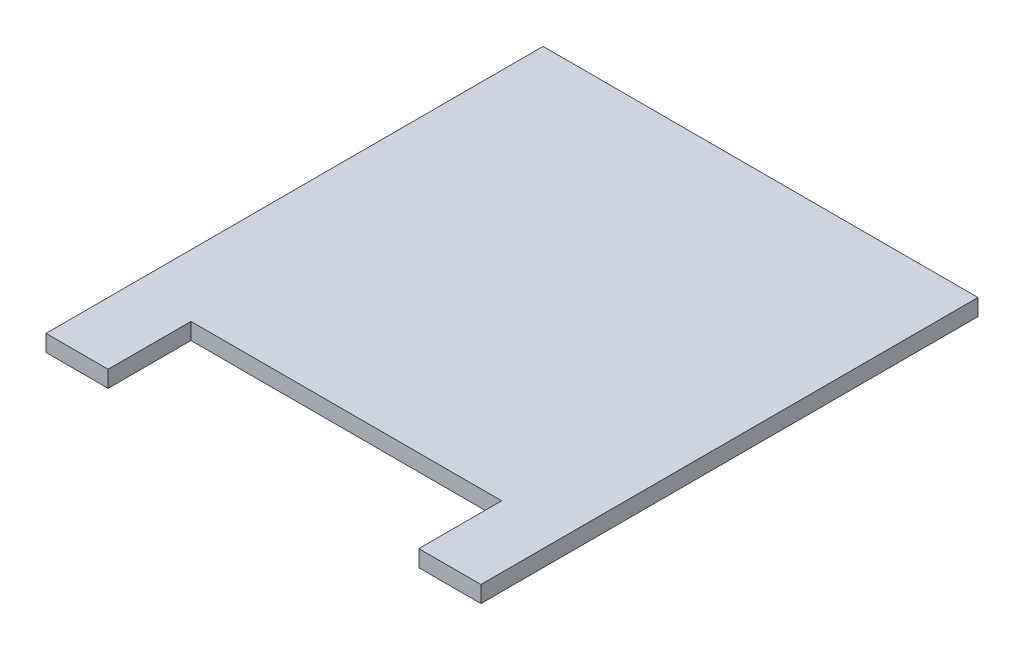
ISO-10303-21;
HEADER;
FILE_DESCRIPTION(('STEP AP214'),'2;1');
FILE_NAME('part.step','',(''),(''),'','','');
FILE_SCHEMA(('AUTOMOTIVE_DESIGN { 1 0 10303 214 1 1 1 1 }'));
ENDSEC;
DATA;
#1=APPLICATION_CONTEXT('core data for automotive mechanical design processes');
#2=APPLICATION_PROTOCOL_DEFINITION('international standard','automotive_design',2000,#1);
#3=PRODUCT_CONTEXT('',#1,'mechanical');
#4=PRODUCT('Part','Part','',(#3));
#5=PRODUCT_RELATED_PRODUCT_CATEGORY('part','',(#4));
#6=PRODUCT_DEFINITION_FORMATION('','',#4);
#7=PRODUCT_DEFINITION_CONTEXT('part definition',#1,'design');
#8=PRODUCT_DEFINITION('design','',#6,#7);
#9=PRODUCT_DEFINITION_SHAPE('','',#8);
#10=(LENGTH_UNIT() NAMED_UNIT(*) SI_UNIT(.MILLI.,.METRE.));
#11=(NAMED_UNIT(*) PLANE_ANGLE_UNIT() SI_UNIT($,.RADIAN.));
#12=(NAMED_UNIT(*) SI_UNIT($,.STERADIAN.) SOLID_ANGLE_UNIT());
#13=UNCERTAINTY_MEASURE_WITH_UNIT(LENGTH_MEASURE(1.E-05),#10,'distance_accuracy_value','');
#14=(GEOMETRIC_REPRESENTATION_CONTEXT(3) GLOBAL_UNCERTAINTY_ASSIGNED_CONTEXT((#13)) GLOBAL_UNIT_ASSIGNED_CONTEXT((#10,
#11,#12)) REPRESENTATION_CONTEXT('',''));
#15=CARTESIAN_POINT('',(0.,0.,0.));
#16=DIRECTION('',(0.,0.,1.));
#17=DIRECTION('',(1.,0.,0.));
#18=AXIS2_PLACEMENT_3D('',#15,#16,#17);
#19=CARTESIAN_POINT('',(210.,16.,240.));
#20=DIRECTION('',(-1.,0.,0.));
#21=DIRECTION('',(0.,0.,1.));
#22=AXIS2_PLACEMENT_3D('',#19,#20,#21);
#23=PLANE('',#22);
#24=DIRECTION('',(0.,0.,-1.));
#25=VECTOR('',#24,1.);
#26=CARTESIAN_POINT('',(210.,0.,240.));
#27=LINE('',#26,#25);
#28=CARTESIAN_POINT('',(210.,0.,240.));
#29=VERTEX_POINT('',#28);
#30=CARTESIAN_POINT('',(210.,0.,-240.));
#31=VERTEX_POINT('',#30);
#32=EDGE_CURVE('E129',#29,#31,#27,.T.);
#33=ORIENTED_EDGE('',*,*,#32,.T.);
#34=DIRECTION('',(0.,-1.,0.));
#35=VECTOR('',#34,1.);
#36=CARTESIAN_POINT('',(210.,16.,-240.));
#37=LINE('',#36,#35);
#38=CARTESIAN_POINT('',(210.,16.,-240.));
#39=VERTEX_POINT('',#38);
#40=EDGE_CURVE('E11',#39,#31,#37,.T.);
#41=ORIENTED_EDGE('',*,*,#40,.F.);
#42=DIRECTION('',(0.,0.,-1.));
#43=VECTOR('',#42,1.);
#44=CARTESIAN_POINT('',(210.,16.,240.));
#45=LINE('',#44,#43);
#46=CARTESIAN_POINT('',(210.,16.,240.));
#47=VERTEX_POINT('',#46);
#48=EDGE_CURVE('E143',#47,#39,#45,.T.);
#49=ORIENTED_EDGE('',*,*,#48,.F.);
#50=DIRECTION('',(0.,-1.,0.));
#51=VECTOR('',#50,1.);
#52=CARTESIAN_POINT('',(210.,16.,240.));
#53=LINE('',#52,#51);
#54=EDGE_CURVE('E125',#47,#29,#53,.T.);
#55=ORIENTED_EDGE('',*,*,#54,.T.);
#56=EDGE_LOOP('',(#33,#41,#49,#55));
#57=FACE_BOUND('',#56,.T.);
#58=ADVANCED_FACE('F33',(#57),#23,.F.);
#59=CARTESIAN_POINT('',(-210.,16.,-240.));
#60=DIRECTION('',(0.,0.,1.));
#61=DIRECTION('',(1.,0.,0.));
#62=AXIS2_PLACEMENT_3D('',#59,#60,#61);
#63=PLANE('',#62);
#64=DIRECTION('',(-1.,0.,0.));
#65=VECTOR('',#64,1.);
#66=CARTESIAN_POINT('',(-210.,0.,-240.));
#67=LINE('',#66,#65);
#68=CARTESIAN_POINT('',(-210.,0.,-240.));
#69=VERTEX_POINT('',#68);
#70=EDGE_CURVE('E132',#31,#69,#67,.T.);
#71=ORIENTED_EDGE('',*,*,#70,.T.);
#72=DIRECTION('',(0.,-1.,0.));
#73=VECTOR('',#72,1.);
#74=CARTESIAN_POINT('',(-210.,16.,-240.));
#75=LINE('',#74,#73);
#76=CARTESIAN_POINT('',(-210.,16.,-240.));
#77=VERTEX_POINT('',#76);
#78=EDGE_CURVE('E41',#77,#69,#75,.T.);
#79=ORIENTED_EDGE('',*,*,#78,.F.);
#80=DIRECTION('',(-1.,0.,0.));
#81=VECTOR('',#80,1.);
#82=CARTESIAN_POINT('',(-210.,16.,-240.));
#83=LINE('',#82,#81);
#84=EDGE_CURVE('E92',#39,#77,#83,.T.);
#85=ORIENTED_EDGE('',*,*,#84,.F.);
#86=ORIENTED_EDGE('',*,*,#40,.T.);
#87=EDGE_LOOP('',(#71,#79,#85,#86));
#88=FACE_BOUND('',#87,.T.);
#89=ADVANCED_FACE('F178',(#88),#63,.F.);
#90=CARTESIAN_POINT('',(-210.,16.,240.));
#91=DIRECTION('',(1.,0.,0.));
#92=DIRECTION('',(0.,0.,-1.));
#93=AXIS2_PLACEMENT_3D('',#90,#91,#92);
#94=PLANE('',#93);
#95=DIRECTION('',(0.,0.,1.));
#96=VECTOR('',#95,1.);
#97=CARTESIAN_POINT('',(-210.,0.,240.));
#98=LINE('',#97,#96);
#99=CARTESIAN_POINT('',(-210.,0.,240.));
#100=VERTEX_POINT('',#99);
#101=EDGE_CURVE('E134',#69,#100,#98,.T.);
#102=ORIENTED_EDGE('',*,*,#101,.T.);
#103=DIRECTION('',(0.,-1.,0.));
#104=VECTOR('',#103,1.);
#105=CARTESIAN_POINT('',(-210.,16.,240.));
#106=LINE('',#105,#104);
#107=CARTESIAN_POINT('',(-210.,16.,240.));
#108=VERTEX_POINT('',#107);
#109=EDGE_CURVE('E150',#108,#100,#106,.T.);
#110=ORIENTED_EDGE('',*,*,#109,.F.);
#111=DIRECTION('',(0.,0.,1.));
#112=VECTOR('',#111,1.);
#113=CARTESIAN_POINT('',(-210.,16.,240.));
#114=LINE('',#113,#112);
#115=EDGE_CURVE('E158',#77,#108,#114,.T.);
#116=ORIENTED_EDGE('',*,*,#115,.F.);
#117=ORIENTED_EDGE('',*,*,#78,.T.);
#118=EDGE_LOOP('',(#102,#110,#116,#117));
#119=FACE_BOUND('',#118,.T.);
#120=ADVANCED_FACE('F156',(#119),#94,.F.);
#121=CARTESIAN_POINT('',(-210.,16.,240.));
#122=DIRECTION('',(0.,0.,-1.));
#123=DIRECTION('',(-1.,0.,0.));
#124=AXIS2_PLACEMENT_3D('',#121,#122,#123);
#125=PLANE('',#124);
#126=DIRECTION('',(1.,0.,0.));
#127=VECTOR('',#126,1.);
#128=CARTESIAN_POINT('',(-210.,0.,240.));
#129=LINE('',#128,#127);
#130=CARTESIAN_POINT('',(-150.,0.,240.));
#131=VERTEX_POINT('',#130);
#132=EDGE_CURVE('E136',#100,#131,#129,.T.);
#133=ORIENTED_EDGE('',*,*,#132,.T.);
#134=DIRECTION('',(0.,-1.,0.));
#135=VECTOR('',#134,1.);
#136=CARTESIAN_POINT('',(-150.,16.,240.));
#137=LINE('',#136,#135);
#138=CARTESIAN_POINT('',(-150.,16.,240.));
#139=VERTEX_POINT('',#138);
#140=EDGE_CURVE('E147',#139,#131,#137,.T.);
#141=ORIENTED_EDGE('',*,*,#140,.F.);
#142=DIRECTION('',(1.,0.,0.));
#143=VECTOR('',#142,1.);
#144=CARTESIAN_POINT('',(-210.,16.,240.));
#145=LINE('',#144,#143);
#146=EDGE_CURVE('E170',#108,#139,#145,.T.);
#147=ORIENTED_EDGE('',*,*,#146,.F.);
#148=ORIENTED_EDGE('',*,*,#109,.T.);
#149=EDGE_LOOP('',(#133,#141,#147,#148));
#150=FACE_BOUND('',#149,.T.);
#151=ADVANCED_FACE('F166',(#150),#125,.F.);
#152=CARTESIAN_POINT('',(-150.,16.,240.));
#153=DIRECTION('',(-1.,0.,0.));
#154=DIRECTION('',(0.,0.,1.));
#155=AXIS2_PLACEMENT_3D('',#152,#153,#154);
#156=PLANE('',#155);
#157=DIRECTION('',(0.,0.,-1.));
#158=VECTOR('',#157,1.);
#159=CARTESIAN_POINT('',(-150.,0.,240.));
#160=LINE('',#159,#158);
#161=CARTESIAN_POINT('',(-150.,0.,160.));
#162=VERTEX_POINT('',#161);
#163=EDGE_CURVE('E138',#131,#162,#160,.T.);
#164=ORIENTED_EDGE('',*,*,#163,.T.);
#165=DIRECTION('',(0.,-1.,0.));
#166=VECTOR('',#165,1.);
#167=CARTESIAN_POINT('',(-150.,16.,160.));
#168=LINE('',#167,#166);
#169=CARTESIAN_POINT('',(-150.,16.,160.));
#170=VERTEX_POINT('',#169);
#171=EDGE_CURVE('E120',#170,#162,#168,.T.);
#172=ORIENTED_EDGE('',*,*,#171,.F.);
#173=DIRECTION('',(0.,0.,-1.));
#174=VECTOR('',#173,1.);
#175=CARTESIAN_POINT('',(-150.,16.,240.));
#176=LINE('',#175,#174);
#177=EDGE_CURVE('E111',#139,#170,#176,.T.);
#178=ORIENTED_EDGE('',*,*,#177,.F.);
#179=ORIENTED_EDGE('',*,*,#140,.T.);
#180=EDGE_LOOP('',(#164,#172,#178,#179));
#181=FACE_BOUND('',#180,.T.);
#182=ADVANCED_FACE('F169',(#181),#156,.F.);
#183=CARTESIAN_POINT('',(-150.,16.,160.));
#184=DIRECTION('',(0.,0.,-1.));
#185=DIRECTION('',(-1.,0.,0.));
#186=AXIS2_PLACEMENT_3D('',#183,#184,#185);
#187=PLANE('',#186);
#188=DIRECTION('',(1.,0.,0.));
#189=VECTOR('',#188,1.);
#190=CARTESIAN_POINT('',(-150.,0.,160.));
#191=LINE('',#190,#189);
#192=CARTESIAN_POINT('',(150.,0.,160.));
#193=VERTEX_POINT('',#192);
#194=EDGE_CURVE('E119',#162,#193,#191,.T.);
#195=ORIENTED_EDGE('',*,*,#194,.T.);
#196=DIRECTION('',(0.,-1.,0.));
#197=VECTOR('',#196,1.);
#198=CARTESIAN_POINT('',(150.,16.,160.));
#199=LINE('',#198,#197);
#200=CARTESIAN_POINT('',(150.,16.,160.));
#201=VERTEX_POINT('',#200);
#202=EDGE_CURVE('E116',#201,#193,#199,.T.);
#203=ORIENTED_EDGE('',*,*,#202,.F.);
#204=DIRECTION('',(1.,0.,0.));
#205=VECTOR('',#204,1.);
#206=CARTESIAN_POINT('',(-150.,16.,160.));
#207=LINE('',#206,#205);
#208=EDGE_CURVE('E105',#170,#201,#207,.T.);
#209=ORIENTED_EDGE('',*,*,#208,.F.);
#210=ORIENTED_EDGE('',*,*,#171,.T.);
#211=EDGE_LOOP('',(#195,#203,#209,#210));
#212=FACE_BOUND('',#211,.T.);
#213=ADVANCED_FACE('F117',(#212),#187,.F.);
#214=CARTESIAN_POINT('',(150.,16.,240.));
#215=DIRECTION('',(1.,0.,0.));
#216=DIRECTION('',(0.,0.,-1.));
#217=AXIS2_PLACEMENT_3D('',#214,#215,#216);
#218=PLANE('',#217);
#219=DIRECTION('',(0.,0.,1.));
#220=VECTOR('',#219,1.);
#221=CARTESIAN_POINT('',(150.,0.,240.));
#222=LINE('',#221,#220);
#223=CARTESIAN_POINT('',(150.,0.,240.));
#224=VERTEX_POINT('',#223);
#225=EDGE_CURVE('E78',#193,#224,#222,.T.);
#226=ORIENTED_EDGE('',*,*,#225,.T.);
#227=DIRECTION('',(0.,-1.,0.));
#228=VECTOR('',#227,1.);
#229=CARTESIAN_POINT('',(150.,16.,240.));
#230=LINE('',#229,#228);
#231=CARTESIAN_POINT('',(150.,16.,240.));
#232=VERTEX_POINT('',#231);
#233=EDGE_CURVE('E121',#232,#224,#230,.T.);
#234=ORIENTED_EDGE('',*,*,#233,.F.);
#235=DIRECTION('',(0.,0.,1.));
#236=VECTOR('',#235,1.);
#237=CARTESIAN_POINT('',(150.,16.,240.));
#238=LINE('',#237,#236);
#239=EDGE_CURVE('E109',#201,#232,#238,.T.);
#240=ORIENTED_EDGE('',*,*,#239,.F.);
#241=ORIENTED_EDGE('',*,*,#202,.T.);
#242=EDGE_LOOP('',(#226,#234,#240,#241));
#243=FACE_BOUND('',#242,.T.);
#244=ADVANCED_FACE('F123',(#243),#218,.F.);
#245=CARTESIAN_POINT('',(150.,16.,240.));
#246=DIRECTION('',(0.,0.,-1.));
#247=DIRECTION('',(-1.,0.,0.));
#248=AXIS2_PLACEMENT_3D('',#245,#246,#247);
#249=PLANE('',#248);
#250=DIRECTION('',(1.,0.,0.));
#251=VECTOR('',#250,1.);
#252=CARTESIAN_POINT('',(150.,0.,240.));
#253=LINE('',#252,#251);
#254=EDGE_CURVE('E84',#224,#29,#253,.T.);
#255=ORIENTED_EDGE('',*,*,#254,.T.);
#256=ORIENTED_EDGE('',*,*,#54,.F.);
#257=DIRECTION('',(1.,0.,0.));
#258=VECTOR('',#257,1.);
#259=CARTESIAN_POINT('',(150.,16.,240.));
#260=LINE('',#259,#258);
#261=EDGE_CURVE('E49',#232,#47,#260,.T.);
#262=ORIENTED_EDGE('',*,*,#261,.F.);
#263=ORIENTED_EDGE('',*,*,#233,.T.);
#264=EDGE_LOOP('',(#255,#256,#262,#263));
#265=FACE_BOUND('',#264,.T.);
#266=ADVANCED_FACE('F194',(#265),#249,.F.);
#267=CARTESIAN_POINT('',(0.,16.,0.));
#268=DIRECTION('',(0.,-1.,0.));
#269=DIRECTION('',(0.,0.,-1.));
#270=AXIS2_PLACEMENT_3D('',#267,#268,#269);
#271=PLANE('',#270);
#272=ORIENTED_EDGE('',*,*,#48,.T.);
#273=ORIENTED_EDGE('',*,*,#84,.T.);
#274=ORIENTED_EDGE('',*,*,#115,.T.);
#275=ORIENTED_EDGE('',*,*,#146,.T.);
#276=ORIENTED_EDGE('',*,*,#177,.T.);
#277=ORIENTED_EDGE('',*,*,#208,.T.);
#278=ORIENTED_EDGE('',*,*,#239,.T.);
#279=ORIENTED_EDGE('',*,*,#261,.T.);
#280=EDGE_LOOP('',(#272,#273,#274,#275,#276,#277,#278,#279));
#281=FACE_BOUND('',#280,.T.);
#282=ADVANCED_FACE('F107',(#281),#271,.F.);
#283=CARTESIAN_POINT('',(0.,0.,0.));
#284=DIRECTION('',(0.,-1.,0.));
#285=DIRECTION('',(0.,0.,-1.));
#286=AXIS2_PLACEMENT_3D('',#283,#284,#285);
#287=PLANE('',#286);
#288=ORIENTED_EDGE('',*,*,#32,.F.);
#289=ORIENTED_EDGE('',*,*,#254,.F.);
#290=ORIENTED_EDGE('',*,*,#225,.F.);
#291=ORIENTED_EDGE('',*,*,#194,.F.);
#292=ORIENTED_EDGE('',*,*,#163,.F.);
#293=ORIENTED_EDGE('',*,*,#132,.F.);
#294=ORIENTED_EDGE('',*,*,#101,.F.);
#295=ORIENTED_EDGE('',*,*,#70,.F.);
#296=EDGE_LOOP('',(#288,#289,#290,#291,#292,#293,#294,#295));
#297=FACE_BOUND('',#296,.T.);
#298=ADVANCED_FACE('F162',(#297),#287,.T.);
#299=CLOSED_SHELL('',(#58,#89,#120,#151,#182,#213,#244,#266,#282,#298));
#300=MANIFOLD_SOLID_BREP('B2',#299);
#301=ADVANCED_BREP_SHAPE_REPRESENTATION('',(#18,#300),#14);
#302=SHAPE_DEFINITION_REPRESENTATION(#9,#301);
ENDSEC;
END-ISO-10303-21;
